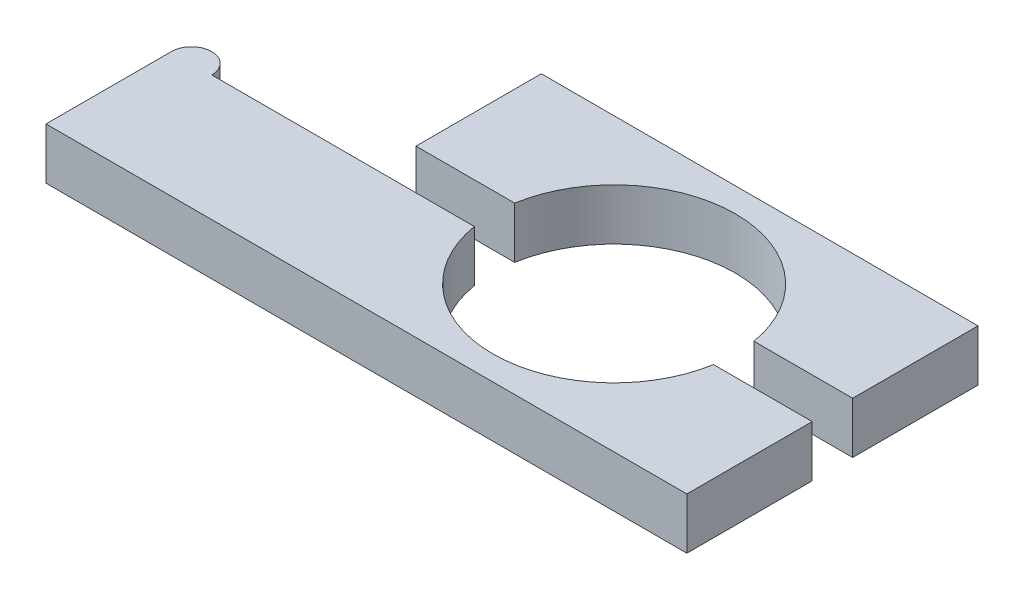
ISO-10303-21;
HEADER;
FILE_DESCRIPTION(('STEP AP214'),'2;1');
FILE_NAME('part.step','',(''),(''),'','','');
FILE_SCHEMA(('AUTOMOTIVE_DESIGN { 1 0 10303 214 1 1 1 1 }'));
ENDSEC;
DATA;
#1=APPLICATION_CONTEXT('core data for automotive mechanical design processes');
#2=APPLICATION_PROTOCOL_DEFINITION('international standard','automotive_design',2000,#1);
#3=PRODUCT_CONTEXT('',#1,'mechanical');
#4=PRODUCT('Part','Part','',(#3));
#5=PRODUCT_RELATED_PRODUCT_CATEGORY('part','',(#4));
#6=PRODUCT_DEFINITION_FORMATION('','',#4);
#7=PRODUCT_DEFINITION_CONTEXT('part definition',#1,'design');
#8=PRODUCT_DEFINITION('design','',#6,#7);
#9=PRODUCT_DEFINITION_SHAPE('','',#8);
#10=(LENGTH_UNIT() NAMED_UNIT(*) SI_UNIT(.MILLI.,.METRE.));
#11=(NAMED_UNIT(*) PLANE_ANGLE_UNIT() SI_UNIT($,.RADIAN.));
#12=(NAMED_UNIT(*) SI_UNIT($,.STERADIAN.) SOLID_ANGLE_UNIT());
#13=UNCERTAINTY_MEASURE_WITH_UNIT(LENGTH_MEASURE(1.E-05),#10,'distance_accuracy_value','');
#14=(GEOMETRIC_REPRESENTATION_CONTEXT(3) GLOBAL_UNCERTAINTY_ASSIGNED_CONTEXT((#13)) GLOBAL_UNIT_ASSIGNED_CONTEXT((#10,
#11,#12)) REPRESENTATION_CONTEXT('',''));
#15=CARTESIAN_POINT('',(0.,0.,0.));
#16=DIRECTION('',(0.,0.,1.));
#17=DIRECTION('',(1.,0.,0.));
#18=AXIS2_PLACEMENT_3D('',#15,#16,#17);
#19=CARTESIAN_POINT('',(21.4446142535215,30.4132733255109,-67.8474278402512));
#20=DIRECTION('',(1.,0.,0.));
#21=DIRECTION('',(0.,0.,-1.));
#22=AXIS2_PLACEMENT_3D('',#19,#20,#21);
#23=PLANE('',#22);
#24=DIRECTION('',(0.,1.,0.));
#25=VECTOR('',#24,1.);
#26=CARTESIAN_POINT('',(21.4446142535215,30.4132733255109,-36.8474278402512));
#27=LINE('',#26,#25);
#28=CARTESIAN_POINT('',(21.4446142535215,30.4132733255109,-36.8474278402512));
#29=VERTEX_POINT('',#28);
#30=CARTESIAN_POINT('',(21.4446142535215,43.1132733255109,-36.8474278402512));
#31=VERTEX_POINT('',#30);
#32=EDGE_CURVE('E134',#29,#31,#27,.T.);
#33=ORIENTED_EDGE('',*,*,#32,.F.);
#34=DIRECTION('',(0.,0.,-1.));
#35=VECTOR('',#34,1.);
#36=CARTESIAN_POINT('',(21.4446142535215,30.4132733255109,-67.8474278402512));
#37=LINE('',#36,#35);
#38=CARTESIAN_POINT('',(21.4446142535215,30.4132733255109,-67.8474278402512));
#39=VERTEX_POINT('',#38);
#40=EDGE_CURVE('E139',#29,#39,#37,.T.);
#41=ORIENTED_EDGE('',*,*,#40,.T.);
#42=DIRECTION('',(0.,1.,0.));
#43=VECTOR('',#42,1.);
#44=CARTESIAN_POINT('',(21.4446142535215,30.4132733255109,-67.8474278402512));
#45=LINE('',#44,#43);
#46=CARTESIAN_POINT('',(21.4446142535215,43.1132733255109,-67.8474278402512));
#47=VERTEX_POINT('',#46);
#48=EDGE_CURVE('E131',#39,#47,#45,.T.);
#49=ORIENTED_EDGE('',*,*,#48,.T.);
#50=DIRECTION('',(0.,0.,-1.));
#51=VECTOR('',#50,1.);
#52=CARTESIAN_POINT('',(21.4446142535215,43.1132733255109,-67.8474278402512));
#53=LINE('',#52,#51);
#54=EDGE_CURVE('E96',#31,#47,#53,.T.);
#55=ORIENTED_EDGE('',*,*,#54,.F.);
#56=EDGE_LOOP('',(#33,#41,#49,#55));
#57=FACE_BOUND('',#56,.T.);
#58=ADVANCED_FACE('F47',(#57),#23,.T.);
#59=CARTESIAN_POINT('',(0.,30.4132733255109,0.));
#60=DIRECTION('',(0.,-1.,0.));
#61=DIRECTION('',(0.,0.,-1.));
#62=AXIS2_PLACEMENT_3D('',#59,#60,#61);
#63=PLANE('',#62);
#64=DIRECTION('',(0.,0.,1.));
#65=VECTOR('',#64,1.);
#66=CARTESIAN_POINT('',(-86.5553857464785,30.4132733255109,-36.8474278402512));
#67=LINE('',#66,#65);
#68=CARTESIAN_POINT('',(-86.5553857464785,30.4132733255109,-67.8474278402512));
#69=VERTEX_POINT('',#68);
#70=CARTESIAN_POINT('',(-86.5553857464785,30.4132733255109,-36.8474278402512));
#71=VERTEX_POINT('',#70);
#72=EDGE_CURVE('E63',#69,#71,#67,.T.);
#73=ORIENTED_EDGE('',*,*,#72,.F.);
#74=DIRECTION('',(-1.,0.,0.));
#75=VECTOR('',#74,1.);
#76=CARTESIAN_POINT('',(-137.055385746478,30.4132733255109,-67.8474278402512));
#77=LINE('',#76,#75);
#78=EDGE_CURVE('E122',#39,#69,#77,.T.);
#79=ORIENTED_EDGE('',*,*,#78,.F.);
#80=ORIENTED_EDGE('',*,*,#40,.F.);
#81=DIRECTION('',(-1.,0.,0.));
#82=VECTOR('',#81,1.);
#83=CARTESIAN_POINT('',(-137.055385746478,30.4132733255109,-36.8474278402512));
#84=LINE('',#83,#82);
#85=CARTESIAN_POINT('',(-2.9749868309804,30.4132733255109,-36.8474278402512));
#86=VERTEX_POINT('',#85);
#87=EDGE_CURVE('E87',#29,#86,#84,.T.);
#88=ORIENTED_EDGE('',*,*,#87,.T.);
#89=CARTESIAN_POINT('',(-32.5553857464785,30.4132733255109,-31.8474278402512));
#90=DIRECTION('',(0.,1.,0.));
#91=DIRECTION('',(0.,0.,1.));
#92=AXIS2_PLACEMENT_3D('',#89,#90,#91);
#93=CIRCLE('',#92,30.);
#94=CARTESIAN_POINT('',(-62.1357846619766,30.4132733255109,-36.8474278402512));
#95=VERTEX_POINT('',#94);
#96=EDGE_CURVE('E127',#86,#95,#93,.T.);
#97=ORIENTED_EDGE('',*,*,#96,.T.);
#98=EDGE_CURVE('E138',#95,#71,#84,.T.);
#99=ORIENTED_EDGE('',*,*,#98,.T.);
#100=EDGE_LOOP('',(#73,#79,#80,#88,#97,#99));
#101=FACE_BOUND('',#100,.T.);
#102=ADVANCED_FACE('F144',(#101),#63,.T.);
#103=CARTESIAN_POINT('',(0.,43.1132733255109,0.));
#104=DIRECTION('',(0.,-1.,0.));
#105=DIRECTION('',(0.,0.,-1.));
#106=AXIS2_PLACEMENT_3D('',#103,#104,#105);
#107=PLANE('',#106);
#108=DIRECTION('',(-1.,0.,0.));
#109=VECTOR('',#108,1.);
#110=CARTESIAN_POINT('',(-137.055385746478,43.1132733255109,-67.8474278402512));
#111=LINE('',#110,#109);
#112=CARTESIAN_POINT('',(-86.5553857464785,43.1132733255109,-67.8474278402512));
#113=VERTEX_POINT('',#112);
#114=EDGE_CURVE('E120',#47,#113,#111,.T.);
#115=ORIENTED_EDGE('',*,*,#114,.T.);
#116=DIRECTION('',(0.,0.,1.));
#117=VECTOR('',#116,1.);
#118=CARTESIAN_POINT('',(-86.5553857464785,43.1132733255109,-36.8474278402512));
#119=LINE('',#118,#117);
#120=CARTESIAN_POINT('',(-86.5553857464785,43.1132733255109,-36.8474278402512));
#121=VERTEX_POINT('',#120);
#122=EDGE_CURVE('E109',#113,#121,#119,.T.);
#123=ORIENTED_EDGE('',*,*,#122,.T.);
#124=DIRECTION('',(-1.,0.,0.));
#125=VECTOR('',#124,1.);
#126=CARTESIAN_POINT('',(-137.055385746478,43.1132733255109,-36.8474278402512));
#127=LINE('',#126,#125);
#128=CARTESIAN_POINT('',(-62.1357846619766,43.1132733255109,-36.8474278402512));
#129=VERTEX_POINT('',#128);
#130=EDGE_CURVE('E12',#129,#121,#127,.T.);
#131=ORIENTED_EDGE('',*,*,#130,.F.);
#132=CARTESIAN_POINT('',(-32.5553857464785,43.1132733255109,-31.8474278402512));
#133=DIRECTION('',(0.,1.,0.));
#134=DIRECTION('',(0.,0.,1.));
#135=AXIS2_PLACEMENT_3D('',#132,#133,#134);
#136=CIRCLE('',#135,30.);
#137=CARTESIAN_POINT('',(-2.9749868309804,43.1132733255109,-36.8474278402512));
#138=VERTEX_POINT('',#137);
#139=EDGE_CURVE('E50',#138,#129,#136,.T.);
#140=ORIENTED_EDGE('',*,*,#139,.F.);
#141=EDGE_CURVE('E55',#31,#138,#127,.T.);
#142=ORIENTED_EDGE('',*,*,#141,.F.);
#143=ORIENTED_EDGE('',*,*,#54,.T.);
#144=EDGE_LOOP('',(#115,#123,#131,#140,#142,#143));
#145=FACE_BOUND('',#144,.T.);
#146=ADVANCED_FACE('F124',(#145),#107,.F.);
#147=CARTESIAN_POINT('',(-32.5553857464785,30.4132733255109,-31.8474278402512));
#148=DIRECTION('',(0.,1.,0.));
#149=DIRECTION('',(0.,0.,1.));
#150=AXIS2_PLACEMENT_3D('',#147,#148,#149);
#151=CYLINDRICAL_SURFACE('',#150,30.);
#152=ORIENTED_EDGE('',*,*,#139,.T.);
#153=DIRECTION('',(0.,1.,0.));
#154=VECTOR('',#153,1.);
#155=CARTESIAN_POINT('',(-62.1357846619766,30.4132733255109,-36.8474278402512));
#156=LINE('',#155,#154);
#157=EDGE_CURVE('E71',#129,#95,#156,.F.);
#158=ORIENTED_EDGE('',*,*,#157,.T.);
#159=ORIENTED_EDGE('',*,*,#96,.F.);
#160=DIRECTION('',(0.,1.,0.));
#161=VECTOR('',#160,1.);
#162=CARTESIAN_POINT('',(-2.9749868309804,30.4132733255109,-36.8474278402512));
#163=LINE('',#162,#161);
#164=EDGE_CURVE('E135',#86,#138,#163,.T.);
#165=ORIENTED_EDGE('',*,*,#164,.T.);
#166=EDGE_LOOP('',(#152,#158,#159,#165));
#167=FACE_BOUND('',#166,.T.);
#168=ADVANCED_FACE('F148',(#167),#151,.F.);
#169=CARTESIAN_POINT('',(-137.055385746478,30.4132733255109,-67.8474278402512));
#170=DIRECTION('',(0.,0.,-1.));
#171=DIRECTION('',(-1.,0.,0.));
#172=AXIS2_PLACEMENT_3D('',#169,#170,#171);
#173=PLANE('',#172);
#174=DIRECTION('',(0.,-1.,0.));
#175=VECTOR('',#174,1.);
#176=CARTESIAN_POINT('',(-86.5553857464785,43.1132733255109,-67.8474278402512));
#177=LINE('',#176,#175);
#178=EDGE_CURVE('E112',#113,#69,#177,.T.);
#179=ORIENTED_EDGE('',*,*,#178,.F.);
#180=ORIENTED_EDGE('',*,*,#114,.F.);
#181=ORIENTED_EDGE('',*,*,#48,.F.);
#182=ORIENTED_EDGE('',*,*,#78,.T.);
#183=EDGE_LOOP('',(#179,#180,#181,#182));
#184=FACE_BOUND('',#183,.T.);
#185=ADVANCED_FACE('F118',(#184),#173,.T.);
#186=CARTESIAN_POINT('',(-137.055385746478,30.4132733255109,-36.8474278402512));
#187=DIRECTION('',(0.,0.,-1.));
#188=DIRECTION('',(-1.,0.,0.));
#189=AXIS2_PLACEMENT_3D('',#186,#187,#188);
#190=PLANE('',#189);
#191=ORIENTED_EDGE('',*,*,#87,.F.);
#192=ORIENTED_EDGE('',*,*,#32,.T.);
#193=ORIENTED_EDGE('',*,*,#141,.T.);
#194=ORIENTED_EDGE('',*,*,#164,.F.);
#195=EDGE_LOOP('',(#191,#192,#193,#194));
#196=FACE_BOUND('',#195,.T.);
#197=ADVANCED_FACE('F150',(#196),#190,.F.);
#198=ORIENTED_EDGE('',*,*,#130,.T.);
#199=DIRECTION('',(0.,-1.,0.));
#200=VECTOR('',#199,1.);
#201=CARTESIAN_POINT('',(-86.5553857464785,43.1132733255109,-36.8474278402512));
#202=LINE('',#201,#200);
#203=EDGE_CURVE('E113',#121,#71,#202,.T.);
#204=ORIENTED_EDGE('',*,*,#203,.T.);
#205=ORIENTED_EDGE('',*,*,#98,.F.);
#206=ORIENTED_EDGE('',*,*,#157,.F.);
#207=EDGE_LOOP('',(#198,#204,#205,#206));
#208=FACE_BOUND('',#207,.T.);
#209=ADVANCED_FACE('F154',(#208),#190,.F.);
#210=CARTESIAN_POINT('',(-86.5553857464785,43.1132733255109,-36.8474278402512));
#211=DIRECTION('',(1.,0.,0.));
#212=DIRECTION('',(0.,0.,-1.));
#213=AXIS2_PLACEMENT_3D('',#210,#211,#212);
#214=PLANE('',#213);
#215=ORIENTED_EDGE('',*,*,#72,.T.);
#216=ORIENTED_EDGE('',*,*,#203,.F.);
#217=ORIENTED_EDGE('',*,*,#122,.F.);
#218=ORIENTED_EDGE('',*,*,#178,.T.);
#219=EDGE_LOOP('',(#215,#216,#217,#218));
#220=FACE_BOUND('',#219,.T.);
#221=ADVANCED_FACE('F111',(#220),#214,.F.);
#222=CLOSED_SHELL('',(#58,#102,#146,#168,#185,#197,#209,#221));
#223=MANIFOLD_SOLID_BREP('B2',#222);
#224=CARTESIAN_POINT('',(21.4446142535215,30.4132733255109,4.15257215974881));
#225=DIRECTION('',(0.,0.,1.));
#226=DIRECTION('',(1.,0.,0.));
#227=AXIS2_PLACEMENT_3D('',#224,#225,#226);
#228=PLANE('',#227);
#229=DIRECTION('',(1.,0.,0.));
#230=VECTOR('',#229,1.);
#231=CARTESIAN_POINT('',(21.4446142535215,43.1132733255109,4.15257215974881));
#232=LINE('',#231,#230);
#233=CARTESIAN_POINT('',(-137.055385746478,43.1132733255109,4.15257215974883));
#234=VERTEX_POINT('',#233);
#235=CARTESIAN_POINT('',(21.4446142535215,43.1132733255109,4.15257215974881));
#236=VERTEX_POINT('',#235);
#237=EDGE_CURVE('E338',#234,#236,#232,.T.);
#238=ORIENTED_EDGE('',*,*,#237,.F.);
#239=DIRECTION('',(0.,1.,0.));
#240=VECTOR('',#239,1.);
#241=CARTESIAN_POINT('',(-137.055385746478,30.4132733255109,4.15257215974883));
#242=LINE('',#241,#240);
#243=CARTESIAN_POINT('',(-137.055385746478,30.4132733255109,4.15257215974883));
#244=VERTEX_POINT('',#243);
#245=EDGE_CURVE('E336',#244,#234,#242,.T.);
#246=ORIENTED_EDGE('',*,*,#245,.F.);
#247=DIRECTION('',(1.,0.,0.));
#248=VECTOR('',#247,1.);
#249=CARTESIAN_POINT('',(21.4446142535215,30.4132733255109,4.15257215974881));
#250=LINE('',#249,#248);
#251=CARTESIAN_POINT('',(21.4446142535215,30.4132733255109,4.15257215974881));
#252=VERTEX_POINT('',#251);
#253=EDGE_CURVE('E329',#244,#252,#250,.T.);
#254=ORIENTED_EDGE('',*,*,#253,.T.);
#255=DIRECTION('',(0.,1.,0.));
#256=VECTOR('',#255,1.);
#257=CARTESIAN_POINT('',(21.4446142535215,30.4132733255109,4.15257215974881));
#258=LINE('',#257,#256);
#259=EDGE_CURVE('E342',#252,#236,#258,.T.);
#260=ORIENTED_EDGE('',*,*,#259,.T.);
#261=EDGE_LOOP('',(#238,#246,#254,#260));
#262=FACE_BOUND('',#261,.T.);
#263=ADVANCED_FACE('F236',(#262),#228,.T.);
#264=CARTESIAN_POINT('',(-32.5553857464785,30.4132733255109,-31.8474278402512));
#265=DIRECTION('',(0.,1.,0.));
#266=DIRECTION('',(0.,0.,1.));
#267=AXIS2_PLACEMENT_3D('',#264,#265,#266);
#268=CYLINDRICAL_SURFACE('',#267,30.);
#269=CARTESIAN_POINT('',(-32.5553857464785,43.1132733255109,-31.8474278402512));
#270=DIRECTION('',(0.,1.,0.));
#271=DIRECTION('',(0.,0.,1.));
#272=AXIS2_PLACEMENT_3D('',#269,#270,#271);
#273=CIRCLE('',#272,30.);
#274=CARTESIAN_POINT('',(-62.1357846619766,43.1132733255109,-26.8474278402512));
#275=VERTEX_POINT('',#274);
#276=CARTESIAN_POINT('',(-2.9749868309804,43.1132733255109,-26.8474278402512));
#277=VERTEX_POINT('',#276);
#278=EDGE_CURVE('E301',#275,#277,#273,.T.);
#279=ORIENTED_EDGE('',*,*,#278,.T.);
#280=DIRECTION('',(0.,1.,0.));
#281=VECTOR('',#280,1.);
#282=CARTESIAN_POINT('',(-2.9749868309804,30.4132733255109,-26.8474278402512));
#283=LINE('',#282,#281);
#284=CARTESIAN_POINT('',(-2.97498683098039,30.4132733255109,-26.8474278402512));
#285=VERTEX_POINT('',#284);
#286=EDGE_CURVE('E45',#277,#285,#283,.F.);
#287=ORIENTED_EDGE('',*,*,#286,.T.);
#288=CARTESIAN_POINT('',(-32.5553857464785,30.4132733255109,-31.8474278402512));
#289=DIRECTION('',(0.,1.,0.));
#290=DIRECTION('',(0.,0.,1.));
#291=AXIS2_PLACEMENT_3D('',#288,#289,#290);
#292=CIRCLE('',#291,30.);
#293=CARTESIAN_POINT('',(-62.1357846619766,30.4132733255109,-26.8474278402512));
#294=VERTEX_POINT('',#293);
#295=EDGE_CURVE('E322',#294,#285,#292,.T.);
#296=ORIENTED_EDGE('',*,*,#295,.F.);
#297=DIRECTION('',(0.,1.,0.));
#298=VECTOR('',#297,1.);
#299=CARTESIAN_POINT('',(-62.1357846619766,30.4132733255109,-26.8474278402512));
#300=LINE('',#299,#298);
#301=EDGE_CURVE('E244',#294,#275,#300,.T.);
#302=ORIENTED_EDGE('',*,*,#301,.T.);
#303=EDGE_LOOP('',(#279,#287,#296,#302));
#304=FACE_BOUND('',#303,.T.);
#305=ADVANCED_FACE('F347',(#304),#268,.F.);
#306=CARTESIAN_POINT('',(0.,43.1132733255109,0.));
#307=DIRECTION('',(0.,-1.,0.));
#308=DIRECTION('',(0.,0.,-1.));
#309=AXIS2_PLACEMENT_3D('',#306,#307,#308);
#310=PLANE('',#309);
#311=DIRECTION('',(0.,0.,-1.));
#312=VECTOR('',#311,1.);
#313=CARTESIAN_POINT('',(21.4446142535215,43.1132733255109,-67.8474278402512));
#314=LINE('',#313,#312);
#315=CARTESIAN_POINT('',(21.4446142535215,43.1132733255109,-26.8474278402512));
#316=VERTEX_POINT('',#315);
#317=EDGE_CURVE('E330',#236,#316,#314,.T.);
#318=ORIENTED_EDGE('',*,*,#317,.T.);
#319=DIRECTION('',(1.,0.,0.));
#320=VECTOR('',#319,1.);
#321=CARTESIAN_POINT('',(-137.055385746478,43.1132733255109,-26.8474278402512));
#322=LINE('',#321,#320);
#323=EDGE_CURVE('E303',#277,#316,#322,.T.);
#324=ORIENTED_EDGE('',*,*,#323,.F.);
#325=ORIENTED_EDGE('',*,*,#278,.F.);
#326=CARTESIAN_POINT('',(-127.055385746478,43.1132733255109,-26.8474278402512));
#327=VERTEX_POINT('',#326);
#328=EDGE_CURVE('E256',#327,#275,#322,.T.);
#329=ORIENTED_EDGE('',*,*,#328,.F.);
#330=CARTESIAN_POINT('',(-132.055385746478,43.1132733255109,-26.8474278402512));
#331=DIRECTION('',(0.,-1.,0.));
#332=DIRECTION('',(0.,0.,-1.));
#333=AXIS2_PLACEMENT_3D('',#330,#331,#332);
#334=CIRCLE('',#333,5.);
#335=CARTESIAN_POINT('',(-137.055385746478,43.1132733255109,-26.8474278402512));
#336=VERTEX_POINT('',#335);
#337=EDGE_CURVE('E297',#327,#336,#334,.F.);
#338=ORIENTED_EDGE('',*,*,#337,.T.);
#339=DIRECTION('',(0.,0.,1.));
#340=VECTOR('',#339,1.);
#341=CARTESIAN_POINT('',(-137.055385746478,43.1132733255109,4.15257215974883));
#342=LINE('',#341,#340);
#343=EDGE_CURVE('E325',#336,#234,#342,.T.);
#344=ORIENTED_EDGE('',*,*,#343,.T.);
#345=ORIENTED_EDGE('',*,*,#237,.T.);
#346=EDGE_LOOP('',(#318,#324,#325,#329,#338,#344,#345));
#347=FACE_BOUND('',#346,.T.);
#348=ADVANCED_FACE('F295',(#347),#310,.F.);
#349=CARTESIAN_POINT('',(0.,30.4132733255109,0.));
#350=DIRECTION('',(0.,-1.,0.));
#351=DIRECTION('',(0.,0.,-1.));
#352=AXIS2_PLACEMENT_3D('',#349,#350,#351);
#353=PLANE('',#352);
#354=DIRECTION('',(1.,0.,0.));
#355=VECTOR('',#354,1.);
#356=CARTESIAN_POINT('',(-137.055385746478,30.4132733255109,-26.8474278402512));
#357=LINE('',#356,#355);
#358=CARTESIAN_POINT('',(21.4446142535215,30.4132733255109,-26.8474278402512));
#359=VERTEX_POINT('',#358);
#360=EDGE_CURVE('E302',#285,#359,#357,.T.);
#361=ORIENTED_EDGE('',*,*,#360,.T.);
#362=DIRECTION('',(0.,0.,-1.));
#363=VECTOR('',#362,1.);
#364=CARTESIAN_POINT('',(21.4446142535215,30.4132733255109,-67.8474278402512));
#365=LINE('',#364,#363);
#366=EDGE_CURVE('E333',#252,#359,#365,.T.);
#367=ORIENTED_EDGE('',*,*,#366,.F.);
#368=ORIENTED_EDGE('',*,*,#253,.F.);
#369=DIRECTION('',(0.,0.,1.));
#370=VECTOR('',#369,1.);
#371=CARTESIAN_POINT('',(-137.055385746478,30.4132733255109,4.15257215974883));
#372=LINE('',#371,#370);
#373=CARTESIAN_POINT('',(-137.055385746478,30.4132733255109,-26.8474278402512));
#374=VERTEX_POINT('',#373);
#375=EDGE_CURVE('E327',#374,#244,#372,.T.);
#376=ORIENTED_EDGE('',*,*,#375,.F.);
#377=CARTESIAN_POINT('',(-132.055385746478,30.4132733255109,-26.8474278402512));
#378=DIRECTION('',(0.,-1.,0.));
#379=DIRECTION('',(0.,0.,-1.));
#380=AXIS2_PLACEMENT_3D('',#377,#378,#379);
#381=CIRCLE('',#380,5.);
#382=CARTESIAN_POINT('',(-127.055385746478,30.4132733255109,-26.8474278402512));
#383=VERTEX_POINT('',#382);
#384=EDGE_CURVE('E310',#374,#383,#381,.T.);
#385=ORIENTED_EDGE('',*,*,#384,.T.);
#386=EDGE_CURVE('E251',#383,#294,#357,.T.);
#387=ORIENTED_EDGE('',*,*,#386,.T.);
#388=ORIENTED_EDGE('',*,*,#295,.T.);
#389=EDGE_LOOP('',(#361,#367,#368,#376,#385,#387,#388));
#390=FACE_BOUND('',#389,.T.);
#391=ADVANCED_FACE('F350',(#390),#353,.T.);
#392=CARTESIAN_POINT('',(21.4446142535215,30.4132733255109,-67.8474278402512));
#393=DIRECTION('',(1.,0.,0.));
#394=DIRECTION('',(0.,0.,-1.));
#395=AXIS2_PLACEMENT_3D('',#392,#393,#394);
#396=PLANE('',#395);
#397=DIRECTION('',(0.,1.,0.));
#398=VECTOR('',#397,1.);
#399=CARTESIAN_POINT('',(21.4446142535215,30.4132733255109,-26.8474278402512));
#400=LINE('',#399,#398);
#401=EDGE_CURVE('E318',#359,#316,#400,.T.);
#402=ORIENTED_EDGE('',*,*,#401,.T.);
#403=ORIENTED_EDGE('',*,*,#317,.F.);
#404=ORIENTED_EDGE('',*,*,#259,.F.);
#405=ORIENTED_EDGE('',*,*,#366,.T.);
#406=EDGE_LOOP('',(#402,#403,#404,#405));
#407=FACE_BOUND('',#406,.T.);
#408=ADVANCED_FACE('F360',(#407),#396,.T.);
#409=CARTESIAN_POINT('',(-137.055385746478,30.4132733255109,4.15257215974883));
#410=DIRECTION('',(-1.,0.,0.));
#411=DIRECTION('',(0.,0.,1.));
#412=AXIS2_PLACEMENT_3D('',#409,#410,#411);
#413=PLANE('',#412);
#414=DIRECTION('',(0.,1.,0.));
#415=VECTOR('',#414,1.);
#416=CARTESIAN_POINT('',(-137.055385746478,30.4132733255109,-26.8474278402512));
#417=LINE('',#416,#415);
#418=EDGE_CURVE('E313',#374,#336,#417,.T.);
#419=ORIENTED_EDGE('',*,*,#418,.F.);
#420=ORIENTED_EDGE('',*,*,#375,.T.);
#421=ORIENTED_EDGE('',*,*,#245,.T.);
#422=ORIENTED_EDGE('',*,*,#343,.F.);
#423=EDGE_LOOP('',(#419,#420,#421,#422));
#424=FACE_BOUND('',#423,.T.);
#425=ADVANCED_FACE('F238',(#424),#413,.T.);
#426=CARTESIAN_POINT('',(-137.055385746478,30.4132733255109,-26.8474278402512));
#427=DIRECTION('',(0.,0.,1.));
#428=DIRECTION('',(1.,0.,0.));
#429=AXIS2_PLACEMENT_3D('',#426,#427,#428);
#430=PLANE('',#429);
#431=ORIENTED_EDGE('',*,*,#386,.F.);
#432=DIRECTION('',(0.,-1.,0.));
#433=VECTOR('',#432,1.);
#434=CARTESIAN_POINT('',(-127.055385746478,54.2936132130099,-26.8474278402512));
#435=LINE('',#434,#433);
#436=EDGE_CURVE('E305',#327,#383,#435,.T.);
#437=ORIENTED_EDGE('',*,*,#436,.F.);
#438=ORIENTED_EDGE('',*,*,#328,.T.);
#439=ORIENTED_EDGE('',*,*,#301,.F.);
#440=EDGE_LOOP('',(#431,#437,#438,#439));
#441=FACE_BOUND('',#440,.T.);
#442=ADVANCED_FACE('F306',(#441),#430,.F.);
#443=ORIENTED_EDGE('',*,*,#323,.T.);
#444=ORIENTED_EDGE('',*,*,#401,.F.);
#445=ORIENTED_EDGE('',*,*,#360,.F.);
#446=ORIENTED_EDGE('',*,*,#286,.F.);
#447=EDGE_LOOP('',(#443,#444,#445,#446));
#448=FACE_BOUND('',#447,.T.);
#449=ADVANCED_FACE('F362',(#448),#430,.F.);
#450=CARTESIAN_POINT('',(-132.055385746478,54.2936132130099,-26.8474278402512));
#451=DIRECTION('',(0.,-1.,0.));
#452=DIRECTION('',(0.,0.,-1.));
#453=AXIS2_PLACEMENT_3D('',#450,#451,#452);
#454=CYLINDRICAL_SURFACE('',#453,5.);
#455=ORIENTED_EDGE('',*,*,#337,.F.);
#456=ORIENTED_EDGE('',*,*,#436,.T.);
#457=ORIENTED_EDGE('',*,*,#384,.F.);
#458=ORIENTED_EDGE('',*,*,#418,.T.);
#459=EDGE_LOOP('',(#455,#456,#457,#458));
#460=FACE_BOUND('',#459,.T.);
#461=ADVANCED_FACE('F312',(#460),#454,.T.);
#462=CLOSED_SHELL('',(#263,#305,#348,#391,#408,#425,#442,#449,#461));
#463=MANIFOLD_SOLID_BREP('B6',#462);
#464=ADVANCED_BREP_SHAPE_REPRESENTATION('',(#18,#223,#463),#14);
#465=SHAPE_DEFINITION_REPRESENTATION(#9,#464);
ENDSEC;
END-ISO-10303-21;
